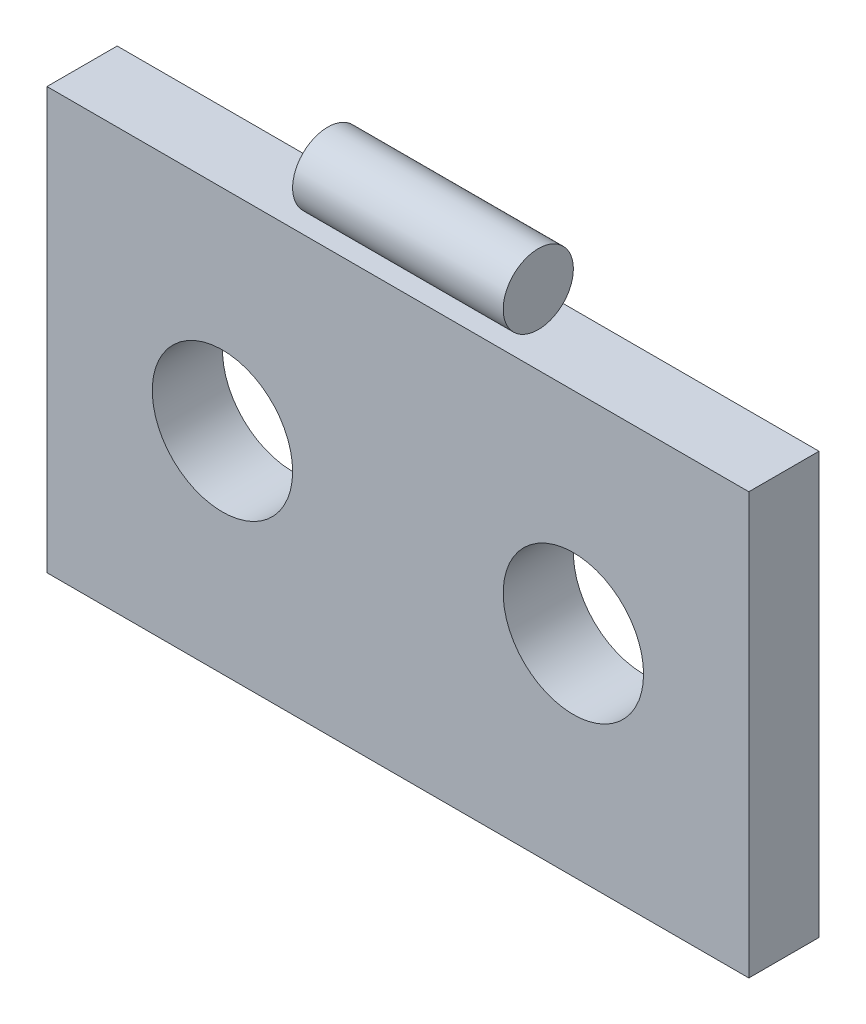
ISO-10303-21;
HEADER;
FILE_DESCRIPTION(('STEP AP214'),'2;1');
FILE_NAME('part.step','',(''),(''),'','','');
FILE_SCHEMA(('AUTOMOTIVE_DESIGN { 1 0 10303 214 1 1 1 1 }'));
ENDSEC;
DATA;
#1=APPLICATION_CONTEXT('core data for automotive mechanical design processes');
#2=APPLICATION_PROTOCOL_DEFINITION('international standard','automotive_design',2000,#1);
#3=PRODUCT_CONTEXT('',#1,'mechanical');
#4=PRODUCT('Part','Part','',(#3));
#5=PRODUCT_RELATED_PRODUCT_CATEGORY('part','',(#4));
#6=PRODUCT_DEFINITION_FORMATION('','',#4);
#7=PRODUCT_DEFINITION_CONTEXT('part definition',#1,'design');
#8=PRODUCT_DEFINITION('design','',#6,#7);
#9=PRODUCT_DEFINITION_SHAPE('','',#8);
#10=(LENGTH_UNIT() NAMED_UNIT(*) SI_UNIT(.MILLI.,.METRE.));
#11=(NAMED_UNIT(*) PLANE_ANGLE_UNIT() SI_UNIT($,.RADIAN.));
#12=(NAMED_UNIT(*) SI_UNIT($,.STERADIAN.) SOLID_ANGLE_UNIT());
#13=UNCERTAINTY_MEASURE_WITH_UNIT(LENGTH_MEASURE(1.E-05),#10,'distance_accuracy_value','');
#14=(GEOMETRIC_REPRESENTATION_CONTEXT(3) GLOBAL_UNCERTAINTY_ASSIGNED_CONTEXT((#13)) GLOBAL_UNIT_ASSIGNED_CONTEXT((#10,
#11,#12)) REPRESENTATION_CONTEXT('',''));
#15=CARTESIAN_POINT('',(0.,0.,0.));
#16=DIRECTION('',(0.,0.,1.));
#17=DIRECTION('',(1.,0.,0.));
#18=AXIS2_PLACEMENT_3D('',#15,#16,#17);
#19=CARTESIAN_POINT('',(0.,32.5,2.5));
#20=DIRECTION('',(1.,0.,0.));
#21=DIRECTION('',(0.,0.,-1.));
#22=AXIS2_PLACEMENT_3D('',#19,#20,#21);
#23=CYLINDRICAL_SURFACE('',#22,2.5);
#24=CARTESIAN_POINT('',(17.5,32.5,2.5));
#25=DIRECTION('',(1.,0.,0.));
#26=DIRECTION('',(0.,0.,-1.));
#27=AXIS2_PLACEMENT_3D('',#24,#25,#26);
#28=CIRCLE('',#27,2.5);
#29=CARTESIAN_POINT('',(17.5,32.5,0.));
#30=VERTEX_POINT('',#29);
#31=EDGE_CURVE('E11',#30,#30,#28,.F.);
#32=ORIENTED_EDGE('',*,*,#31,.F.);
#33=EDGE_LOOP('',(#32));
#34=FACE_BOUND('',#33,.T.);
#35=CARTESIAN_POINT('',(32.5,32.5,2.5));
#36=DIRECTION('',(1.,0.,0.));
#37=DIRECTION('',(0.,0.,-1.));
#38=AXIS2_PLACEMENT_3D('',#35,#36,#37);
#39=CIRCLE('',#38,2.5);
#40=CARTESIAN_POINT('',(32.5,32.5,0.));
#41=VERTEX_POINT('',#40);
#42=EDGE_CURVE('E47',#41,#41,#39,.F.);
#43=ORIENTED_EDGE('',*,*,#42,.T.);
#44=EDGE_LOOP('',(#43));
#45=FACE_BOUND('',#44,.T.);
#46=ADVANCED_FACE('F41',(#34,#45),#23,.T.);
#47=CARTESIAN_POINT('',(32.5,-30.1137817357255,0.));
#48=DIRECTION('',(1.,0.,0.));
#49=DIRECTION('',(0.,0.,-1.));
#50=AXIS2_PLACEMENT_3D('',#47,#48,#49);
#51=PLANE('',#50);
#52=ORIENTED_EDGE('',*,*,#42,.F.);
#53=EDGE_LOOP('',(#52));
#54=FACE_BOUND('',#53,.T.);
#55=ADVANCED_FACE('F54',(#54),#51,.T.);
#56=CARTESIAN_POINT('',(17.5,-30.1137817357255,0.));
#57=DIRECTION('',(1.,0.,0.));
#58=DIRECTION('',(0.,0.,-1.));
#59=AXIS2_PLACEMENT_3D('',#56,#57,#58);
#60=PLANE('',#59);
#61=ORIENTED_EDGE('',*,*,#31,.T.);
#62=EDGE_LOOP('',(#61));
#63=FACE_BOUND('',#62,.T.);
#64=ADVANCED_FACE('F56',(#63),#60,.F.);
#65=CLOSED_SHELL('',(#46,#55,#64));
#66=MANIFOLD_SOLID_BREP('B2',#65);
#67=CARTESIAN_POINT('',(0.,0.,5.));
#68=DIRECTION('',(1.,0.,0.));
#69=DIRECTION('',(0.,0.,-1.));
#70=AXIS2_PLACEMENT_3D('',#67,#68,#69);
#71=PLANE('',#70);
#72=DIRECTION('',(0.,-1.,0.));
#73=VECTOR('',#72,1.);
#74=CARTESIAN_POINT('',(0.,0.,0.));
#75=LINE('',#74,#73);
#76=CARTESIAN_POINT('',(0.,30.,0.));
#77=VERTEX_POINT('',#76);
#78=CARTESIAN_POINT('',(0.,0.,0.));
#79=VERTEX_POINT('',#78);
#80=EDGE_CURVE('E148',#77,#79,#75,.T.);
#81=ORIENTED_EDGE('',*,*,#80,.T.);
#82=DIRECTION('',(0.,0.,-1.));
#83=VECTOR('',#82,1.);
#84=CARTESIAN_POINT('',(0.,0.,5.));
#85=LINE('',#84,#83);
#86=CARTESIAN_POINT('',(0.,0.,5.));
#87=VERTEX_POINT('',#86);
#88=EDGE_CURVE('E39',#87,#79,#85,.T.);
#89=ORIENTED_EDGE('',*,*,#88,.F.);
#90=DIRECTION('',(0.,-1.,0.));
#91=VECTOR('',#90,1.);
#92=CARTESIAN_POINT('',(0.,0.,5.));
#93=LINE('',#92,#91);
#94=CARTESIAN_POINT('',(0.,30.,5.));
#95=VERTEX_POINT('',#94);
#96=EDGE_CURVE('E135',#95,#87,#93,.T.);
#97=ORIENTED_EDGE('',*,*,#96,.F.);
#98=DIRECTION('',(0.,0.,-1.));
#99=VECTOR('',#98,1.);
#100=CARTESIAN_POINT('',(0.,30.,5.));
#101=LINE('',#100,#99);
#102=EDGE_CURVE('E144',#95,#77,#101,.T.);
#103=ORIENTED_EDGE('',*,*,#102,.T.);
#104=EDGE_LOOP('',(#81,#89,#97,#103));
#105=FACE_BOUND('',#104,.T.);
#106=ADVANCED_FACE('F82',(#105),#71,.F.);
#107=CARTESIAN_POINT('',(0.,0.,5.));
#108=DIRECTION('',(0.,1.,0.));
#109=DIRECTION('',(0.,0.,1.));
#110=AXIS2_PLACEMENT_3D('',#107,#108,#109);
#111=PLANE('',#110);
#112=DIRECTION('',(1.,0.,0.));
#113=VECTOR('',#112,1.);
#114=CARTESIAN_POINT('',(0.,0.,0.));
#115=LINE('',#114,#113);
#116=CARTESIAN_POINT('',(50.,0.,0.));
#117=VERTEX_POINT('',#116);
#118=EDGE_CURVE('E139',#79,#117,#115,.T.);
#119=ORIENTED_EDGE('',*,*,#118,.T.);
#120=DIRECTION('',(0.,0.,-1.));
#121=VECTOR('',#120,1.);
#122=CARTESIAN_POINT('',(50.,0.,5.));
#123=LINE('',#122,#121);
#124=CARTESIAN_POINT('',(50.,0.,5.));
#125=VERTEX_POINT('',#124);
#126=EDGE_CURVE('E92',#125,#117,#123,.T.);
#127=ORIENTED_EDGE('',*,*,#126,.F.);
#128=DIRECTION('',(1.,0.,0.));
#129=VECTOR('',#128,1.);
#130=CARTESIAN_POINT('',(0.,0.,5.));
#131=LINE('',#130,#129);
#132=EDGE_CURVE('E130',#87,#125,#131,.T.);
#133=ORIENTED_EDGE('',*,*,#132,.F.);
#134=ORIENTED_EDGE('',*,*,#88,.T.);
#135=EDGE_LOOP('',(#119,#127,#133,#134));
#136=FACE_BOUND('',#135,.T.);
#137=ADVANCED_FACE('F138',(#136),#111,.F.);
#138=CARTESIAN_POINT('',(50.,0.,5.));
#139=DIRECTION('',(-1.,0.,0.));
#140=DIRECTION('',(0.,0.,1.));
#141=AXIS2_PLACEMENT_3D('',#138,#139,#140);
#142=PLANE('',#141);
#143=DIRECTION('',(0.,1.,0.));
#144=VECTOR('',#143,1.);
#145=CARTESIAN_POINT('',(50.,0.,0.));
#146=LINE('',#145,#144);
#147=CARTESIAN_POINT('',(50.,30.,0.));
#148=VERTEX_POINT('',#147);
#149=EDGE_CURVE('E117',#117,#148,#146,.T.);
#150=ORIENTED_EDGE('',*,*,#149,.T.);
#151=DIRECTION('',(0.,0.,-1.));
#152=VECTOR('',#151,1.);
#153=CARTESIAN_POINT('',(50.,30.,5.));
#154=LINE('',#153,#152);
#155=CARTESIAN_POINT('',(50.,30.,5.));
#156=VERTEX_POINT('',#155);
#157=EDGE_CURVE('E140',#156,#148,#154,.T.);
#158=ORIENTED_EDGE('',*,*,#157,.F.);
#159=DIRECTION('',(0.,1.,0.));
#160=VECTOR('',#159,1.);
#161=CARTESIAN_POINT('',(50.,0.,5.));
#162=LINE('',#161,#160);
#163=EDGE_CURVE('E133',#125,#156,#162,.T.);
#164=ORIENTED_EDGE('',*,*,#163,.F.);
#165=ORIENTED_EDGE('',*,*,#126,.T.);
#166=EDGE_LOOP('',(#150,#158,#164,#165));
#167=FACE_BOUND('',#166,.T.);
#168=ADVANCED_FACE('F142',(#167),#142,.F.);
#169=CARTESIAN_POINT('',(0.,30.,5.));
#170=DIRECTION('',(0.,-1.,0.));
#171=DIRECTION('',(0.,0.,-1.));
#172=AXIS2_PLACEMENT_3D('',#169,#170,#171);
#173=PLANE('',#172);
#174=DIRECTION('',(-1.,0.,0.));
#175=VECTOR('',#174,1.);
#176=CARTESIAN_POINT('',(0.,30.,0.));
#177=LINE('',#176,#175);
#178=EDGE_CURVE('E123',#148,#77,#177,.T.);
#179=ORIENTED_EDGE('',*,*,#178,.T.);
#180=ORIENTED_EDGE('',*,*,#102,.F.);
#181=DIRECTION('',(-1.,0.,0.));
#182=VECTOR('',#181,1.);
#183=CARTESIAN_POINT('',(0.,30.,5.));
#184=LINE('',#183,#182);
#185=EDGE_CURVE('E85',#156,#95,#184,.T.);
#186=ORIENTED_EDGE('',*,*,#185,.F.);
#187=ORIENTED_EDGE('',*,*,#157,.T.);
#188=EDGE_LOOP('',(#179,#180,#186,#187));
#189=FACE_BOUND('',#188,.T.);
#190=ADVANCED_FACE('F172',(#189),#173,.F.);
#191=CARTESIAN_POINT('',(0.,30.,5.));
#192=DIRECTION('',(0.,0.,-1.));
#193=DIRECTION('',(-1.,0.,0.));
#194=AXIS2_PLACEMENT_3D('',#191,#192,#193);
#195=PLANE('',#194);
#196=CARTESIAN_POINT('',(37.5,15.,5.));
#197=DIRECTION('',(0.,0.,1.));
#198=DIRECTION('',(1.,0.,0.));
#199=AXIS2_PLACEMENT_3D('',#196,#197,#198);
#200=CIRCLE('',#199,5.);
#201=CARTESIAN_POINT('',(42.5,15.,5.));
#202=VERTEX_POINT('',#201);
#203=EDGE_CURVE('E223',#202,#202,#200,.T.);
#204=ORIENTED_EDGE('',*,*,#203,.F.);
#205=EDGE_LOOP('',(#204));
#206=FACE_BOUND('',#205,.T.);
#207=CARTESIAN_POINT('',(12.5,15.,5.));
#208=DIRECTION('',(0.,0.,1.));
#209=DIRECTION('',(1.,0.,0.));
#210=AXIS2_PLACEMENT_3D('',#207,#208,#209);
#211=CIRCLE('',#210,5.);
#212=CARTESIAN_POINT('',(17.5,15.,5.));
#213=VERTEX_POINT('',#212);
#214=EDGE_CURVE('E225',#213,#213,#211,.T.);
#215=ORIENTED_EDGE('',*,*,#214,.F.);
#216=EDGE_LOOP('',(#215));
#217=FACE_BOUND('',#216,.T.);
#218=ORIENTED_EDGE('',*,*,#96,.T.);
#219=ORIENTED_EDGE('',*,*,#132,.T.);
#220=ORIENTED_EDGE('',*,*,#163,.T.);
#221=ORIENTED_EDGE('',*,*,#185,.T.);
#222=EDGE_LOOP('',(#218,#219,#220,#221));
#223=FACE_BOUND('',#222,.T.);
#224=ADVANCED_FACE('F131',(#206,#217,#223),#195,.F.);
#225=CARTESIAN_POINT('',(0.,30.,0.));
#226=DIRECTION('',(0.,0.,-1.));
#227=DIRECTION('',(-1.,0.,0.));
#228=AXIS2_PLACEMENT_3D('',#225,#226,#227);
#229=PLANE('',#228);
#230=CARTESIAN_POINT('',(37.5,15.,0.));
#231=DIRECTION('',(0.,0.,1.));
#232=DIRECTION('',(1.,0.,0.));
#233=AXIS2_PLACEMENT_3D('',#230,#231,#232);
#234=CIRCLE('',#233,5.);
#235=CARTESIAN_POINT('',(42.5,15.,0.));
#236=VERTEX_POINT('',#235);
#237=EDGE_CURVE('E220',#236,#236,#234,.T.);
#238=ORIENTED_EDGE('',*,*,#237,.T.);
#239=EDGE_LOOP('',(#238));
#240=FACE_BOUND('',#239,.T.);
#241=CARTESIAN_POINT('',(12.5,15.,0.));
#242=DIRECTION('',(0.,0.,1.));
#243=DIRECTION('',(1.,0.,0.));
#244=AXIS2_PLACEMENT_3D('',#241,#242,#243);
#245=CIRCLE('',#244,5.);
#246=CARTESIAN_POINT('',(17.5,15.,0.));
#247=VERTEX_POINT('',#246);
#248=EDGE_CURVE('E151',#247,#247,#245,.T.);
#249=ORIENTED_EDGE('',*,*,#248,.T.);
#250=EDGE_LOOP('',(#249));
#251=FACE_BOUND('',#250,.T.);
#252=ORIENTED_EDGE('',*,*,#80,.F.);
#253=ORIENTED_EDGE('',*,*,#178,.F.);
#254=ORIENTED_EDGE('',*,*,#149,.F.);
#255=ORIENTED_EDGE('',*,*,#118,.F.);
#256=EDGE_LOOP('',(#252,#253,#254,#255));
#257=FACE_BOUND('',#256,.T.);
#258=ADVANCED_FACE('F160',(#240,#251,#257),#229,.T.);
#259=CARTESIAN_POINT('',(12.5,15.,0.));
#260=DIRECTION('',(0.,0.,1.));
#261=DIRECTION('',(1.,0.,0.));
#262=AXIS2_PLACEMENT_3D('',#259,#260,#261);
#263=CYLINDRICAL_SURFACE('',#262,5.);
#264=ORIENTED_EDGE('',*,*,#248,.F.);
#265=EDGE_LOOP('',(#264));
#266=FACE_BOUND('',#265,.T.);
#267=ORIENTED_EDGE('',*,*,#214,.T.);
#268=EDGE_LOOP('',(#267));
#269=FACE_BOUND('',#268,.T.);
#270=ADVANCED_FACE('F162',(#266,#269),#263,.F.);
#271=CARTESIAN_POINT('',(37.5,15.,0.));
#272=DIRECTION('',(0.,0.,1.));
#273=DIRECTION('',(1.,0.,0.));
#274=AXIS2_PLACEMENT_3D('',#271,#272,#273);
#275=CYLINDRICAL_SURFACE('',#274,5.);
#276=ORIENTED_EDGE('',*,*,#237,.F.);
#277=EDGE_LOOP('',(#276));
#278=FACE_BOUND('',#277,.T.);
#279=ORIENTED_EDGE('',*,*,#203,.T.);
#280=EDGE_LOOP('',(#279));
#281=FACE_BOUND('',#280,.T.);
#282=ADVANCED_FACE('F169',(#278,#281),#275,.F.);
#283=CLOSED_SHELL('',(#106,#137,#168,#190,#224,#258,#270,#282));
#284=MANIFOLD_SOLID_BREP('B6',#283);
#285=ADVANCED_BREP_SHAPE_REPRESENTATION('',(#18,#66,#284),#14);
#286=SHAPE_DEFINITION_REPRESENTATION(#9,#285);
ENDSEC;
END-ISO-10303-21;
